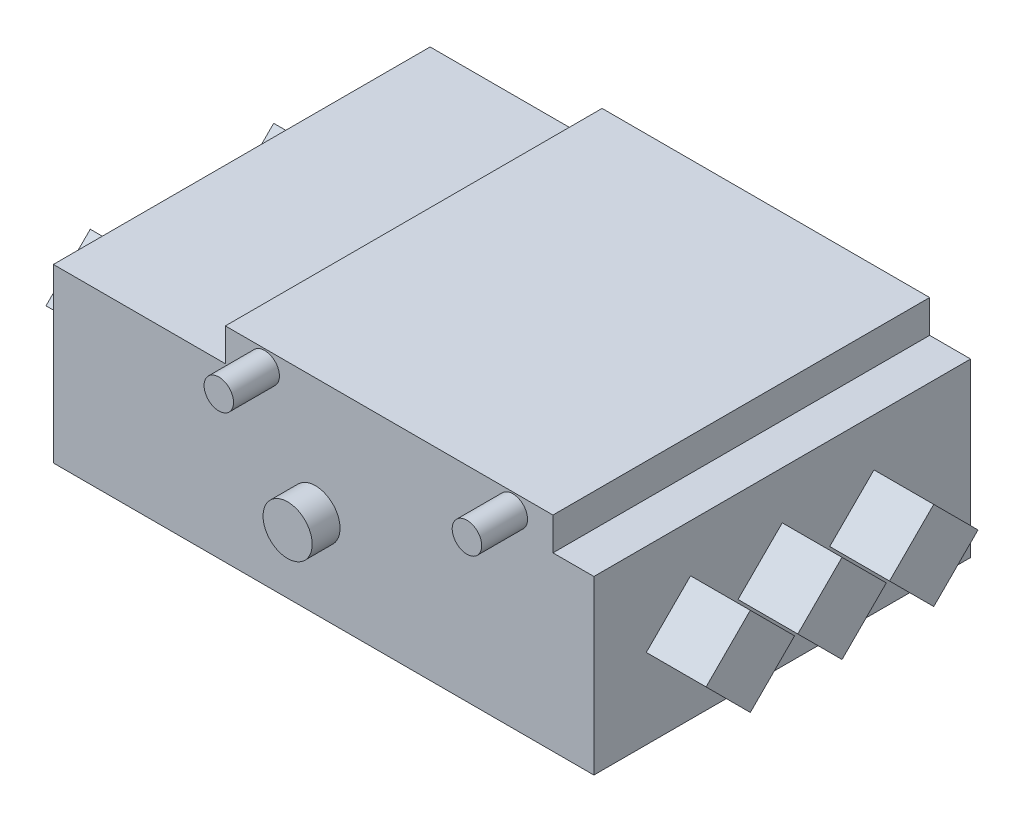
ISO-10303-21;
HEADER;
FILE_DESCRIPTION(('STEP AP214'),'2;1');
FILE_NAME('part.step','',(''),(''),'','','');
FILE_SCHEMA(('AUTOMOTIVE_DESIGN { 1 0 10303 214 1 1 1 1 }'));
ENDSEC;
DATA;
#1=APPLICATION_CONTEXT('core data for automotive mechanical design processes');
#2=APPLICATION_PROTOCOL_DEFINITION('international standard','automotive_design',2000,#1);
#3=PRODUCT_CONTEXT('',#1,'mechanical');
#4=PRODUCT('Part','Part','',(#3));
#5=PRODUCT_RELATED_PRODUCT_CATEGORY('part','',(#4));
#6=PRODUCT_DEFINITION_FORMATION('','',#4);
#7=PRODUCT_DEFINITION_CONTEXT('part definition',#1,'design');
#8=PRODUCT_DEFINITION('design','',#6,#7);
#9=PRODUCT_DEFINITION_SHAPE('','',#8);
#10=(LENGTH_UNIT() NAMED_UNIT(*) SI_UNIT(.MILLI.,.METRE.));
#11=(NAMED_UNIT(*) PLANE_ANGLE_UNIT() SI_UNIT($,.RADIAN.));
#12=(NAMED_UNIT(*) SI_UNIT($,.STERADIAN.) SOLID_ANGLE_UNIT());
#13=UNCERTAINTY_MEASURE_WITH_UNIT(LENGTH_MEASURE(1.E-05),#10,'distance_accuracy_value','');
#14=(GEOMETRIC_REPRESENTATION_CONTEXT(3) GLOBAL_UNCERTAINTY_ASSIGNED_CONTEXT((#13)) GLOBAL_UNIT_ASSIGNED_CONTEXT((#10,
#11,#12)) REPRESENTATION_CONTEXT('',''));
#15=CARTESIAN_POINT('',(0.,0.,0.));
#16=DIRECTION('',(0.,0.,1.));
#17=DIRECTION('',(1.,0.,0.));
#18=AXIS2_PLACEMENT_3D('',#15,#16,#17);
#19=CARTESIAN_POINT('',(-201.5,-3.63879009309075,198.011479041326));
#20=DIRECTION('',(0.,-0.707106781186546,-0.707106781186549));
#21=DIRECTION('',(0.,0.707106781186549,-0.707106781186546));
#22=AXIS2_PLACEMENT_3D('',#19,#20,#21);
#23=PLANE('',#22);
#24=DIRECTION('',(0.,-0.707106781186549,0.707106781186546));
#25=VECTOR('',#24,1.);
#26=CARTESIAN_POINT('',(-165.,-3.63879009309076,198.011479041326));
#27=LINE('',#26,#25);
#28=CARTESIAN_POINT('',(-165.,23.3726889482354,171.));
#29=VERTEX_POINT('',#28);
#30=CARTESIAN_POINT('',(-165.,-3.63879009309076,198.011479041326));
#31=VERTEX_POINT('',#30);
#32=EDGE_CURVE('E11',#29,#31,#27,.T.);
#33=ORIENTED_EDGE('',*,*,#32,.F.);
#34=DIRECTION('',(1.,0.,0.));
#35=VECTOR('',#34,1.);
#36=CARTESIAN_POINT('',(-201.5,23.3726889482354,171.));
#37=LINE('',#36,#35);
#38=CARTESIAN_POINT('',(-201.5,23.3726889482354,171.));
#39=VERTEX_POINT('',#38);
#40=EDGE_CURVE('E393',#39,#29,#37,.T.);
#41=ORIENTED_EDGE('',*,*,#40,.F.);
#42=DIRECTION('',(0.,-0.707106781186549,0.707106781186546));
#43=VECTOR('',#42,1.);
#44=CARTESIAN_POINT('',(-201.5,-3.63879009309075,198.011479041326));
#45=LINE('',#44,#43);
#46=CARTESIAN_POINT('',(-201.5,-3.63879009309075,198.011479041326));
#47=VERTEX_POINT('',#46);
#48=EDGE_CURVE('E402',#39,#47,#45,.T.);
#49=ORIENTED_EDGE('',*,*,#48,.T.);
#50=DIRECTION('',(1.,0.,0.));
#51=VECTOR('',#50,1.);
#52=CARTESIAN_POINT('',(-201.5,-3.63879009309075,198.011479041326));
#53=LINE('',#52,#51);
#54=EDGE_CURVE('E41',#47,#31,#53,.T.);
#55=ORIENTED_EDGE('',*,*,#54,.T.);
#56=EDGE_LOOP('',(#33,#41,#49,#55));
#57=FACE_BOUND('',#56,.T.);
#58=ADVANCED_FACE('F34',(#57),#23,.F.);
#59=CARTESIAN_POINT('',(-201.5,-3.63879009309075,198.011479041326));
#60=DIRECTION('',(0.,0.707106781186548,-0.707106781186546));
#61=DIRECTION('',(0.,0.707106781186547,0.707106781186549));
#62=AXIS2_PLACEMENT_3D('',#59,#60,#61);
#63=PLANE('',#62);
#64=DIRECTION('',(0.,-0.707106781186547,-0.707106781186549));
#65=VECTOR('',#64,1.);
#66=CARTESIAN_POINT('',(-165.,-3.63879009309076,198.011479041326));
#67=LINE('',#66,#65);
#68=CARTESIAN_POINT('',(-165.,-30.6502691344168,171.));
#69=VERTEX_POINT('',#68);
#70=EDGE_CURVE('E51',#31,#69,#67,.T.);
#71=ORIENTED_EDGE('',*,*,#70,.F.);
#72=ORIENTED_EDGE('',*,*,#54,.F.);
#73=DIRECTION('',(0.,-0.707106781186547,-0.707106781186549));
#74=VECTOR('',#73,1.);
#75=CARTESIAN_POINT('',(-201.5,-3.63879009309075,198.011479041326));
#76=LINE('',#75,#74);
#77=CARTESIAN_POINT('',(-201.5,-30.6502691344168,171.));
#78=VERTEX_POINT('',#77);
#79=EDGE_CURVE('E405',#47,#78,#76,.T.);
#80=ORIENTED_EDGE('',*,*,#79,.T.);
#81=DIRECTION('',(1.,0.,0.));
#82=VECTOR('',#81,1.);
#83=CARTESIAN_POINT('',(-201.5,-30.6502691344168,171.));
#84=LINE('',#83,#82);
#85=EDGE_CURVE('E412',#78,#69,#84,.T.);
#86=ORIENTED_EDGE('',*,*,#85,.T.);
#87=EDGE_LOOP('',(#71,#72,#80,#86));
#88=FACE_BOUND('',#87,.T.);
#89=ADVANCED_FACE('F418',(#88),#63,.F.);
#90=CARTESIAN_POINT('',(-201.5,-30.6502691344168,171.));
#91=DIRECTION('',(0.,0.707106781186546,0.707106781186548));
#92=DIRECTION('',(0.,-0.707106781186549,0.707106781186547));
#93=AXIS2_PLACEMENT_3D('',#90,#91,#92);
#94=PLANE('',#93);
#95=DIRECTION('',(0.,0.707106781186549,-0.707106781186547));
#96=VECTOR('',#95,1.);
#97=CARTESIAN_POINT('',(-165.,-30.6502691344168,171.));
#98=LINE('',#97,#96);
#99=CARTESIAN_POINT('',(-165.,-3.63879009309066,143.988520958674));
#100=VERTEX_POINT('',#99);
#101=EDGE_CURVE('E410',#69,#100,#98,.T.);
#102=ORIENTED_EDGE('',*,*,#101,.F.);
#103=ORIENTED_EDGE('',*,*,#85,.F.);
#104=DIRECTION('',(0.,0.707106781186549,-0.707106781186547));
#105=VECTOR('',#104,1.);
#106=CARTESIAN_POINT('',(-201.5,-30.6502691344168,171.));
#107=LINE('',#106,#105);
#108=CARTESIAN_POINT('',(-201.5,-3.63879009309065,143.988520958674));
#109=VERTEX_POINT('',#108);
#110=EDGE_CURVE('E408',#78,#109,#107,.T.);
#111=ORIENTED_EDGE('',*,*,#110,.T.);
#112=DIRECTION('',(1.,0.,0.));
#113=VECTOR('',#112,1.);
#114=CARTESIAN_POINT('',(-201.5,-3.63879009309065,143.988520958674));
#115=LINE('',#114,#113);
#116=EDGE_CURVE('E399',#109,#100,#115,.T.);
#117=ORIENTED_EDGE('',*,*,#116,.T.);
#118=EDGE_LOOP('',(#102,#103,#111,#117));
#119=FACE_BOUND('',#118,.T.);
#120=ADVANCED_FACE('F422',(#119),#94,.F.);
#121=CARTESIAN_POINT('',(-201.5,0.,0.));
#122=DIRECTION('',(1.,0.,0.));
#123=DIRECTION('',(0.,0.,1.));
#124=AXIS2_PLACEMENT_3D('',#121,#122,#123);
#125=PLANE('',#124);
#126=ORIENTED_EDGE('',*,*,#48,.F.);
#127=DIRECTION('',(0.,0.707106781186546,0.707106781186549));
#128=VECTOR('',#127,1.);
#129=CARTESIAN_POINT('',(-201.5,23.3726889482354,171.));
#130=LINE('',#129,#128);
#131=EDGE_CURVE('E396',#109,#39,#130,.T.);
#132=ORIENTED_EDGE('',*,*,#131,.F.);
#133=ORIENTED_EDGE('',*,*,#110,.F.);
#134=ORIENTED_EDGE('',*,*,#79,.F.);
#135=EDGE_LOOP('',(#126,#132,#133,#134));
#136=FACE_BOUND('',#135,.T.);
#137=ADVANCED_FACE('F431',(#136),#125,.F.);
#138=CARTESIAN_POINT('',(-201.5,23.3726889482354,171.));
#139=DIRECTION('',(0.,-0.707106781186549,0.707106781186546));
#140=DIRECTION('',(0.,-0.707106781186546,-0.707106781186549));
#141=AXIS2_PLACEMENT_3D('',#138,#139,#140);
#142=PLANE('',#141);
#143=DIRECTION('',(0.,0.707106781186546,0.707106781186549));
#144=VECTOR('',#143,1.);
#145=CARTESIAN_POINT('',(-165.,23.3726889482354,171.));
#146=LINE('',#145,#144);
#147=EDGE_CURVE('E391',#100,#29,#146,.T.);
#148=ORIENTED_EDGE('',*,*,#147,.F.);
#149=ORIENTED_EDGE('',*,*,#116,.F.);
#150=ORIENTED_EDGE('',*,*,#131,.T.);
#151=ORIENTED_EDGE('',*,*,#40,.T.);
#152=EDGE_LOOP('',(#148,#149,#150,#151));
#153=FACE_BOUND('',#152,.T.);
#154=ADVANCED_FACE('F428',(#153),#142,.F.);
#155=CARTESIAN_POINT('',(-201.5,-3.63879009308997,86.0114790413261));
#156=DIRECTION('',(0.,-0.707106781186546,-0.707106781186549));
#157=DIRECTION('',(0.,0.707106781186549,-0.707106781186546));
#158=AXIS2_PLACEMENT_3D('',#155,#156,#157);
#159=PLANE('',#158);
#160=DIRECTION('',(0.,-0.707106781186549,0.707106781186546));
#161=VECTOR('',#160,1.);
#162=CARTESIAN_POINT('',(-165.,-3.63879009308998,86.0114790413261));
#163=LINE('',#162,#161);
#164=CARTESIAN_POINT('',(-165.,23.3726889482362,59.));
#165=VERTEX_POINT('',#164);
#166=CARTESIAN_POINT('',(-165.,-3.63879009308998,86.0114790413261));
#167=VERTEX_POINT('',#166);
#168=EDGE_CURVE('E389',#165,#167,#163,.T.);
#169=ORIENTED_EDGE('',*,*,#168,.F.);
#170=DIRECTION('',(1.,0.,0.));
#171=VECTOR('',#170,1.);
#172=CARTESIAN_POINT('',(-201.5,23.3726889482362,59.));
#173=LINE('',#172,#171);
#174=CARTESIAN_POINT('',(-201.5,23.3726889482362,59.));
#175=VERTEX_POINT('',#174);
#176=EDGE_CURVE('E386',#175,#165,#173,.T.);
#177=ORIENTED_EDGE('',*,*,#176,.F.);
#178=DIRECTION('',(0.,-0.707106781186549,0.707106781186546));
#179=VECTOR('',#178,1.);
#180=CARTESIAN_POINT('',(-201.5,-3.63879009308997,86.0114790413261));
#181=LINE('',#180,#179);
#182=CARTESIAN_POINT('',(-201.5,-3.63879009308997,86.0114790413261));
#183=VERTEX_POINT('',#182);
#184=EDGE_CURVE('E369',#175,#183,#181,.T.);
#185=ORIENTED_EDGE('',*,*,#184,.T.);
#186=DIRECTION('',(1.,0.,0.));
#187=VECTOR('',#186,1.);
#188=CARTESIAN_POINT('',(-201.5,-3.63879009308997,86.0114790413261));
#189=LINE('',#188,#187);
#190=EDGE_CURVE('E366',#183,#167,#189,.T.);
#191=ORIENTED_EDGE('',*,*,#190,.T.);
#192=EDGE_LOOP('',(#169,#177,#185,#191));
#193=FACE_BOUND('',#192,.T.);
#194=ADVANCED_FACE('F438',(#193),#159,.F.);
#195=CARTESIAN_POINT('',(-201.5,23.3726889482362,59.));
#196=DIRECTION('',(0.,-0.707106781186549,0.707106781186546));
#197=DIRECTION('',(0.,-0.707106781186546,-0.707106781186549));
#198=AXIS2_PLACEMENT_3D('',#195,#196,#197);
#199=PLANE('',#198);
#200=DIRECTION('',(0.,0.707106781186546,0.707106781186549));
#201=VECTOR('',#200,1.);
#202=CARTESIAN_POINT('',(-165.,23.3726889482362,59.));
#203=LINE('',#202,#201);
#204=CARTESIAN_POINT('',(-165.,-3.63879009308986,31.9885209586739));
#205=VERTEX_POINT('',#204);
#206=EDGE_CURVE('E383',#205,#165,#203,.T.);
#207=ORIENTED_EDGE('',*,*,#206,.F.);
#208=DIRECTION('',(1.,0.,0.));
#209=VECTOR('',#208,1.);
#210=CARTESIAN_POINT('',(-201.5,-3.63879009308987,31.9885209586739));
#211=LINE('',#210,#209);
#212=CARTESIAN_POINT('',(-201.5,-3.63879009308987,31.9885209586739));
#213=VERTEX_POINT('',#212);
#214=EDGE_CURVE('E380',#213,#205,#211,.T.);
#215=ORIENTED_EDGE('',*,*,#214,.F.);
#216=DIRECTION('',(0.,0.707106781186546,0.707106781186549));
#217=VECTOR('',#216,1.);
#218=CARTESIAN_POINT('',(-201.5,23.3726889482362,59.));
#219=LINE('',#218,#217);
#220=EDGE_CURVE('E374',#213,#175,#219,.T.);
#221=ORIENTED_EDGE('',*,*,#220,.T.);
#222=ORIENTED_EDGE('',*,*,#176,.T.);
#223=EDGE_LOOP('',(#207,#215,#221,#222));
#224=FACE_BOUND('',#223,.T.);
#225=ADVANCED_FACE('F471',(#224),#199,.F.);
#226=CARTESIAN_POINT('',(-201.5,-30.650269134416,59.));
#227=DIRECTION('',(0.,0.707106781186546,0.707106781186549));
#228=DIRECTION('',(0.,-0.707106781186549,0.707106781186546));
#229=AXIS2_PLACEMENT_3D('',#226,#227,#228);
#230=PLANE('',#229);
#231=DIRECTION('',(0.,0.707106781186549,-0.707106781186546));
#232=VECTOR('',#231,1.);
#233=CARTESIAN_POINT('',(-165.,-30.650269134416,59.));
#234=LINE('',#233,#232);
#235=CARTESIAN_POINT('',(-165.,-30.650269134416,58.9999999999999));
#236=VERTEX_POINT('',#235);
#237=EDGE_CURVE('E377',#236,#205,#234,.T.);
#238=ORIENTED_EDGE('',*,*,#237,.F.);
#239=DIRECTION('',(1.,0.,0.));
#240=VECTOR('',#239,1.);
#241=CARTESIAN_POINT('',(-201.5,-30.650269134416,59.));
#242=LINE('',#241,#240);
#243=CARTESIAN_POINT('',(-201.5,-30.650269134416,59.));
#244=VERTEX_POINT('',#243);
#245=EDGE_CURVE('E359',#244,#236,#242,.T.);
#246=ORIENTED_EDGE('',*,*,#245,.F.);
#247=DIRECTION('',(0.,0.707106781186549,-0.707106781186546));
#248=VECTOR('',#247,1.);
#249=CARTESIAN_POINT('',(-201.5,-30.650269134416,59.));
#250=LINE('',#249,#248);
#251=EDGE_CURVE('E371',#244,#213,#250,.T.);
#252=ORIENTED_EDGE('',*,*,#251,.T.);
#253=ORIENTED_EDGE('',*,*,#214,.T.);
#254=EDGE_LOOP('',(#238,#246,#252,#253));
#255=FACE_BOUND('',#254,.T.);
#256=ADVANCED_FACE('F481',(#255),#230,.F.);
#257=CARTESIAN_POINT('',(-201.5,0.,0.));
#258=DIRECTION('',(1.,0.,0.));
#259=DIRECTION('',(0.,0.,1.));
#260=AXIS2_PLACEMENT_3D('',#257,#258,#259);
#261=PLANE('',#260);
#262=ORIENTED_EDGE('',*,*,#184,.F.);
#263=ORIENTED_EDGE('',*,*,#220,.F.);
#264=ORIENTED_EDGE('',*,*,#251,.F.);
#265=DIRECTION('',(0.,-0.707106781186546,-0.707106781186549));
#266=VECTOR('',#265,1.);
#267=CARTESIAN_POINT('',(-201.5,-3.63879009308997,86.0114790413261));
#268=LINE('',#267,#266);
#269=EDGE_CURVE('E363',#183,#244,#268,.T.);
#270=ORIENTED_EDGE('',*,*,#269,.F.);
#271=EDGE_LOOP('',(#262,#263,#264,#270));
#272=FACE_BOUND('',#271,.T.);
#273=ADVANCED_FACE('F491',(#272),#261,.F.);
#274=CARTESIAN_POINT('',(-201.5,-3.63879009308997,86.0114790413261));
#275=DIRECTION('',(0.,0.707106781186549,-0.707106781186546));
#276=DIRECTION('',(0.,0.707106781186546,0.707106781186549));
#277=AXIS2_PLACEMENT_3D('',#274,#275,#276);
#278=PLANE('',#277);
#279=DIRECTION('',(0.,-0.707106781186546,-0.707106781186549));
#280=VECTOR('',#279,1.);
#281=CARTESIAN_POINT('',(-165.,-3.63879009308998,86.0114790413261));
#282=LINE('',#281,#280);
#283=EDGE_CURVE('E356',#167,#236,#282,.T.);
#284=ORIENTED_EDGE('',*,*,#283,.F.);
#285=ORIENTED_EDGE('',*,*,#190,.F.);
#286=ORIENTED_EDGE('',*,*,#269,.T.);
#287=ORIENTED_EDGE('',*,*,#245,.T.);
#288=EDGE_LOOP('',(#284,#285,#286,#287));
#289=FACE_BOUND('',#288,.T.);
#290=ADVANCED_FACE('F501',(#289),#278,.F.);
#291=CARTESIAN_POINT('',(165.,52.5,230.));
#292=DIRECTION('',(-1.,0.,0.));
#293=DIRECTION('',(0.,-1.,0.));
#294=AXIS2_PLACEMENT_3D('',#291,#292,#293);
#295=PLANE('',#294);
#296=DIRECTION('',(0.,-0.707106781186549,0.707106781186546));
#297=VECTOR('',#296,1.);
#298=CARTESIAN_POINT('',(165.,-3.63879009309037,142.011479041326));
#299=LINE('',#298,#297);
#300=CARTESIAN_POINT('',(165.,23.3726889482358,115.));
#301=VERTEX_POINT('',#300);
#302=CARTESIAN_POINT('',(165.,-3.63879009309036,142.011479041326));
#303=VERTEX_POINT('',#302);
#304=EDGE_CURVE('E240',#301,#303,#299,.T.);
#305=ORIENTED_EDGE('',*,*,#304,.F.);
#306=DIRECTION('',(0.,0.707106781186546,0.707106781186549));
#307=VECTOR('',#306,1.);
#308=CARTESIAN_POINT('',(165.,23.3726889482358,115.));
#309=LINE('',#308,#307);
#310=CARTESIAN_POINT('',(165.,-3.63879009309027,87.9885209586739));
#311=VERTEX_POINT('',#310);
#312=EDGE_CURVE('E253',#311,#301,#309,.T.);
#313=ORIENTED_EDGE('',*,*,#312,.F.);
#314=DIRECTION('',(0.,0.707106781186549,-0.707106781186546));
#315=VECTOR('',#314,1.);
#316=CARTESIAN_POINT('',(165.,-30.6502691344164,115.));
#317=LINE('',#316,#315);
#318=CARTESIAN_POINT('',(165.,-30.6502691344164,115.));
#319=VERTEX_POINT('',#318);
#320=EDGE_CURVE('E262',#319,#311,#317,.T.);
#321=ORIENTED_EDGE('',*,*,#320,.F.);
#322=DIRECTION('',(0.,-0.707106781186546,-0.707106781186549));
#323=VECTOR('',#322,1.);
#324=CARTESIAN_POINT('',(165.,-3.63879009309037,142.011479041326));
#325=LINE('',#324,#323);
#326=EDGE_CURVE('E243',#303,#319,#325,.T.);
#327=ORIENTED_EDGE('',*,*,#326,.F.);
#328=EDGE_LOOP('',(#305,#313,#321,#327));
#329=FACE_BOUND('',#328,.T.);
#330=DIRECTION('',(0.,1.,0.));
#331=VECTOR('',#330,1.);
#332=CARTESIAN_POINT('',(165.,52.5,0.));
#333=LINE('',#332,#331);
#334=CARTESIAN_POINT('',(165.,-52.5,0.));
#335=VERTEX_POINT('',#334);
#336=CARTESIAN_POINT('',(165.,52.5,0.));
#337=VERTEX_POINT('',#336);
#338=EDGE_CURVE('E823',#335,#337,#333,.T.);
#339=ORIENTED_EDGE('',*,*,#338,.T.);
#340=DIRECTION('',(0.,0.,-1.));
#341=VECTOR('',#340,1.);
#342=CARTESIAN_POINT('',(165.,52.5,230.));
#343=LINE('',#342,#341);
#344=CARTESIAN_POINT('',(165.,52.5,230.));
#345=VERTEX_POINT('',#344);
#346=EDGE_CURVE('E360',#345,#337,#343,.T.);
#347=ORIENTED_EDGE('',*,*,#346,.F.);
#348=DIRECTION('',(0.,1.,0.));
#349=VECTOR('',#348,1.);
#350=CARTESIAN_POINT('',(165.,52.5,230.));
#351=LINE('',#350,#349);
#352=CARTESIAN_POINT('',(165.,-52.5,230.));
#353=VERTEX_POINT('',#352);
#354=EDGE_CURVE('E801',#353,#345,#351,.T.);
#355=ORIENTED_EDGE('',*,*,#354,.F.);
#356=DIRECTION('',(0.,0.,-1.));
#357=VECTOR('',#356,1.);
#358=CARTESIAN_POINT('',(165.,-52.5,230.));
#359=LINE('',#358,#357);
#360=EDGE_CURVE('E849',#353,#335,#359,.T.);
#361=ORIENTED_EDGE('',*,*,#360,.T.);
#362=EDGE_LOOP('',(#339,#347,#355,#361));
#363=FACE_BOUND('',#362,.T.);
#364=DIRECTION('',(0.,-0.707106781186549,0.707106781186546));
#365=VECTOR('',#364,1.);
#366=CARTESIAN_POINT('',(165.,-3.63879009308998,86.0114790413261));
#367=LINE('',#366,#365);
#368=CARTESIAN_POINT('',(165.,23.3726889482362,59.));
#369=VERTEX_POINT('',#368);
#370=CARTESIAN_POINT('',(165.,-3.63879009308998,86.0114790413261));
#371=VERTEX_POINT('',#370);
#372=EDGE_CURVE('E278',#369,#371,#367,.T.);
#373=ORIENTED_EDGE('',*,*,#372,.F.);
#374=DIRECTION('',(0.,0.707106781186546,0.707106781186549));
#375=VECTOR('',#374,1.);
#376=CARTESIAN_POINT('',(165.,23.3726889482362,59.));
#377=LINE('',#376,#375);
#378=CARTESIAN_POINT('',(165.,-3.63879009308986,31.9885209586739));
#379=VERTEX_POINT('',#378);
#380=EDGE_CURVE('E283',#379,#369,#377,.T.);
#381=ORIENTED_EDGE('',*,*,#380,.F.);
#382=DIRECTION('',(0.,0.707106781186549,-0.707106781186546));
#383=VECTOR('',#382,1.);
#384=CARTESIAN_POINT('',(165.,-30.650269134416,59.));
#385=LINE('',#384,#383);
#386=CARTESIAN_POINT('',(165.,-30.650269134416,58.9999999999999));
#387=VERTEX_POINT('',#386);
#388=EDGE_CURVE('E295',#387,#379,#385,.T.);
#389=ORIENTED_EDGE('',*,*,#388,.F.);
#390=DIRECTION('',(0.,-0.707106781186546,-0.707106781186549));
#391=VECTOR('',#390,1.);
#392=CARTESIAN_POINT('',(165.,-3.63879009308998,86.0114790413261));
#393=LINE('',#392,#391);
#394=EDGE_CURVE('E292',#371,#387,#393,.T.);
#395=ORIENTED_EDGE('',*,*,#394,.F.);
#396=EDGE_LOOP('',(#373,#381,#389,#395));
#397=FACE_BOUND('',#396,.T.);
#398=DIRECTION('',(0.,-0.707106781186549,0.707106781186546));
#399=VECTOR('',#398,1.);
#400=CARTESIAN_POINT('',(165.,-3.63879009309076,198.011479041326));
#401=LINE('',#400,#399);
#402=CARTESIAN_POINT('',(165.,23.3726889482354,171.));
#403=VERTEX_POINT('',#402);
#404=CARTESIAN_POINT('',(165.,-3.63879009309076,198.011479041326));
#405=VERTEX_POINT('',#404);
#406=EDGE_CURVE('E239',#403,#405,#401,.T.);
#407=ORIENTED_EDGE('',*,*,#406,.F.);
#408=DIRECTION('',(0.,0.707106781186546,0.707106781186549));
#409=VECTOR('',#408,1.);
#410=CARTESIAN_POINT('',(165.,23.3726889482354,171.));
#411=LINE('',#410,#409);
#412=CARTESIAN_POINT('',(165.,-3.63879009309066,143.988520958674));
#413=VERTEX_POINT('',#412);
#414=EDGE_CURVE('E236',#413,#403,#411,.T.);
#415=ORIENTED_EDGE('',*,*,#414,.F.);
#416=DIRECTION('',(0.,0.707106781186549,-0.707106781186547));
#417=VECTOR('',#416,1.);
#418=CARTESIAN_POINT('',(165.,-30.6502691344168,171.));
#419=LINE('',#418,#417);
#420=CARTESIAN_POINT('',(165.,-30.6502691344168,171.));
#421=VERTEX_POINT('',#420);
#422=EDGE_CURVE('E868',#421,#413,#419,.T.);
#423=ORIENTED_EDGE('',*,*,#422,.F.);
#424=DIRECTION('',(0.,-0.707106781186547,-0.707106781186549));
#425=VECTOR('',#424,1.);
#426=CARTESIAN_POINT('',(165.,-3.63879009309076,198.011479041326));
#427=LINE('',#426,#425);
#428=EDGE_CURVE('E863',#405,#421,#427,.T.);
#429=ORIENTED_EDGE('',*,*,#428,.F.);
#430=EDGE_LOOP('',(#407,#415,#423,#429));
#431=FACE_BOUND('',#430,.T.);
#432=ADVANCED_FACE('F511',(#329,#363,#397,#431),#295,.F.);
#433=CARTESIAN_POINT('',(0.,0.,230.));
#434=DIRECTION('',(0.,0.,1.));
#435=DIRECTION('',(1.,0.,0.));
#436=AXIS2_PLACEMENT_3D('',#433,#434,#435);
#437=PLANE('',#436);
#438=CARTESIAN_POINT('',(-36.,62.5,230.));
#439=DIRECTION('',(0.,0.,1.));
#440=DIRECTION('',(1.,0.,0.));
#441=AXIS2_PLACEMENT_3D('',#438,#439,#440);
#442=CIRCLE('',#441,9.00000000000001);
#443=CARTESIAN_POINT('',(-26.9999999999999,62.5,230.));
#444=VERTEX_POINT('',#443);
#445=EDGE_CURVE('E318',#444,#444,#442,.T.);
#446=ORIENTED_EDGE('',*,*,#445,.F.);
#447=EDGE_LOOP('',(#446));
#448=FACE_BOUND('',#447,.T.);
#449=ORIENTED_EDGE('',*,*,#354,.T.);
#450=DIRECTION('',(-1.,0.,0.));
#451=VECTOR('',#450,1.);
#452=CARTESIAN_POINT('',(-165.,52.5,230.));
#453=LINE('',#452,#451);
#454=CARTESIAN_POINT('',(140.,52.5,230.));
#455=VERTEX_POINT('',#454);
#456=EDGE_CURVE('E790',#345,#455,#453,.T.);
#457=ORIENTED_EDGE('',*,*,#456,.T.);
#458=DIRECTION('',(0.,-1.,0.));
#459=VECTOR('',#458,1.);
#460=CARTESIAN_POINT('',(140.,72.5,230.));
#461=LINE('',#460,#459);
#462=CARTESIAN_POINT('',(140.,72.5,230.));
#463=VERTEX_POINT('',#462);
#464=EDGE_CURVE('E340',#463,#455,#461,.T.);
#465=ORIENTED_EDGE('',*,*,#464,.F.);
#466=DIRECTION('',(1.,0.,0.));
#467=VECTOR('',#466,1.);
#468=CARTESIAN_POINT('',(140.,72.5,230.));
#469=LINE('',#468,#467);
#470=CARTESIAN_POINT('',(-59.9999999999999,72.5,230.));
#471=VERTEX_POINT('',#470);
#472=EDGE_CURVE('E338',#471,#463,#469,.T.);
#473=ORIENTED_EDGE('',*,*,#472,.F.);
#474=DIRECTION('',(0.,-1.,0.));
#475=VECTOR('',#474,1.);
#476=CARTESIAN_POINT('',(-59.9999999999999,72.5,230.));
#477=LINE('',#476,#475);
#478=CARTESIAN_POINT('',(-59.9999999999999,52.5,230.));
#479=VERTEX_POINT('',#478);
#480=EDGE_CURVE('E353',#471,#479,#477,.T.);
#481=ORIENTED_EDGE('',*,*,#480,.T.);
#482=CARTESIAN_POINT('',(-165.,52.5,230.));
#483=VERTEX_POINT('',#482);
#484=EDGE_CURVE('E804',#479,#483,#453,.T.);
#485=ORIENTED_EDGE('',*,*,#484,.T.);
#486=DIRECTION('',(0.,-1.,0.));
#487=VECTOR('',#486,1.);
#488=CARTESIAN_POINT('',(-165.,52.5,230.));
#489=LINE('',#488,#487);
#490=CARTESIAN_POINT('',(-165.,-52.5,230.));
#491=VERTEX_POINT('',#490);
#492=EDGE_CURVE('E803',#483,#491,#489,.T.);
#493=ORIENTED_EDGE('',*,*,#492,.T.);
#494=DIRECTION('',(1.,0.,0.));
#495=VECTOR('',#494,1.);
#496=CARTESIAN_POINT('',(-165.,-52.5,230.));
#497=LINE('',#496,#495);
#498=EDGE_CURVE('E833',#491,#353,#497,.T.);
#499=ORIENTED_EDGE('',*,*,#498,.T.);
#500=EDGE_LOOP('',(#449,#457,#465,#473,#481,#485,#493,#499));
#501=FACE_BOUND('',#500,.T.);
#502=CARTESIAN_POINT('',(115.5,62.5,230.));
#503=DIRECTION('',(0.,0.,1.));
#504=DIRECTION('',(1.,0.,0.));
#505=AXIS2_PLACEMENT_3D('',#502,#503,#504);
#506=CIRCLE('',#505,9.00000000000001);
#507=CARTESIAN_POINT('',(124.5,62.5,230.));
#508=VERTEX_POINT('',#507);
#509=EDGE_CURVE('E321',#508,#508,#506,.T.);
#510=ORIENTED_EDGE('',*,*,#509,.F.);
#511=EDGE_LOOP('',(#510));
#512=FACE_BOUND('',#511,.T.);
#513=CARTESIAN_POINT('',(-4.99999999999995,0.499999999999994,230.));
#514=DIRECTION('',(0.,0.,1.));
#515=DIRECTION('',(1.,0.,0.));
#516=AXIS2_PLACEMENT_3D('',#513,#514,#515);
#517=CIRCLE('',#516,15.);
#518=CARTESIAN_POINT('',(10.,0.499999999999994,230.));
#519=VERTEX_POINT('',#518);
#520=EDGE_CURVE('E311',#519,#519,#517,.T.);
#521=ORIENTED_EDGE('',*,*,#520,.F.);
#522=EDGE_LOOP('',(#521));
#523=FACE_BOUND('',#522,.T.);
#524=ADVANCED_FACE('F624',(#448,#501,#512,#523),#437,.T.);
#525=CARTESIAN_POINT('',(-165.,52.5,230.));
#526=DIRECTION('',(0.,-1.,0.));
#527=DIRECTION('',(0.,0.,-1.));
#528=AXIS2_PLACEMENT_3D('',#525,#526,#527);
#529=PLANE('',#528);
#530=DIRECTION('',(0.,0.,-1.));
#531=VECTOR('',#530,1.);
#532=CARTESIAN_POINT('',(140.,52.5,0.));
#533=LINE('',#532,#531);
#534=CARTESIAN_POINT('',(140.,52.5,0.));
#535=VERTEX_POINT('',#534);
#536=EDGE_CURVE('E327',#455,#535,#533,.T.);
#537=ORIENTED_EDGE('',*,*,#536,.F.);
#538=ORIENTED_EDGE('',*,*,#456,.F.);
#539=ORIENTED_EDGE('',*,*,#346,.T.);
#540=DIRECTION('',(-1.,0.,0.));
#541=VECTOR('',#540,1.);
#542=CARTESIAN_POINT('',(-165.,52.5,0.));
#543=LINE('',#542,#541);
#544=EDGE_CURVE('E792',#337,#535,#543,.T.);
#545=ORIENTED_EDGE('',*,*,#544,.T.);
#546=EDGE_LOOP('',(#537,#538,#539,#545));
#547=FACE_BOUND('',#546,.T.);
#548=ADVANCED_FACE('F782',(#547),#529,.F.);
#549=DIRECTION('',(0.,0.,1.));
#550=VECTOR('',#549,1.);
#551=CARTESIAN_POINT('',(-60.,52.5,0.));
#552=LINE('',#551,#550);
#553=CARTESIAN_POINT('',(-60.,52.5,0.));
#554=VERTEX_POINT('',#553);
#555=EDGE_CURVE('E334',#554,#479,#552,.T.);
#556=ORIENTED_EDGE('',*,*,#555,.F.);
#557=CARTESIAN_POINT('',(-165.,52.5,0.));
#558=VERTEX_POINT('',#557);
#559=EDGE_CURVE('E825',#554,#558,#543,.T.);
#560=ORIENTED_EDGE('',*,*,#559,.T.);
#561=DIRECTION('',(0.,0.,-1.));
#562=VECTOR('',#561,1.);
#563=CARTESIAN_POINT('',(-165.,52.5,230.));
#564=LINE('',#563,#562);
#565=EDGE_CURVE('E843',#483,#558,#564,.T.);
#566=ORIENTED_EDGE('',*,*,#565,.F.);
#567=ORIENTED_EDGE('',*,*,#484,.F.);
#568=EDGE_LOOP('',(#556,#560,#566,#567));
#569=FACE_BOUND('',#568,.T.);
#570=ADVANCED_FACE('F521',(#569),#529,.F.);
#571=CARTESIAN_POINT('',(-165.,52.5,230.));
#572=DIRECTION('',(1.,0.,0.));
#573=DIRECTION('',(0.,1.,0.));
#574=AXIS2_PLACEMENT_3D('',#571,#572,#573);
#575=PLANE('',#574);
#576=ORIENTED_EDGE('',*,*,#32,.T.);
#577=ORIENTED_EDGE('',*,*,#70,.T.);
#578=ORIENTED_EDGE('',*,*,#101,.T.);
#579=ORIENTED_EDGE('',*,*,#147,.T.);
#580=EDGE_LOOP('',(#576,#577,#578,#579));
#581=FACE_BOUND('',#580,.T.);
#582=ORIENTED_EDGE('',*,*,#168,.T.);
#583=ORIENTED_EDGE('',*,*,#283,.T.);
#584=ORIENTED_EDGE('',*,*,#237,.T.);
#585=ORIENTED_EDGE('',*,*,#206,.T.);
#586=EDGE_LOOP('',(#582,#583,#584,#585));
#587=FACE_BOUND('',#586,.T.);
#588=DIRECTION('',(0.,-1.,0.));
#589=VECTOR('',#588,1.);
#590=CARTESIAN_POINT('',(-165.,52.5,0.));
#591=LINE('',#590,#589);
#592=CARTESIAN_POINT('',(-165.,-52.5,0.));
#593=VERTEX_POINT('',#592);
#594=EDGE_CURVE('E837',#558,#593,#591,.T.);
#595=ORIENTED_EDGE('',*,*,#594,.T.);
#596=DIRECTION('',(0.,0.,-1.));
#597=VECTOR('',#596,1.);
#598=CARTESIAN_POINT('',(-165.,-52.5,230.));
#599=LINE('',#598,#597);
#600=EDGE_CURVE('E846',#491,#593,#599,.T.);
#601=ORIENTED_EDGE('',*,*,#600,.F.);
#602=ORIENTED_EDGE('',*,*,#492,.F.);
#603=ORIENTED_EDGE('',*,*,#565,.T.);
#604=EDGE_LOOP('',(#595,#601,#602,#603));
#605=FACE_BOUND('',#604,.T.);
#606=ADVANCED_FACE('F425',(#581,#587,#605),#575,.F.);
#607=CARTESIAN_POINT('',(-165.,-52.5,230.));
#608=DIRECTION('',(0.,1.,0.));
#609=DIRECTION('',(0.,0.,1.));
#610=AXIS2_PLACEMENT_3D('',#607,#608,#609);
#611=PLANE('',#610);
#612=DIRECTION('',(1.,0.,0.));
#613=VECTOR('',#612,1.);
#614=CARTESIAN_POINT('',(-165.,-52.5,0.));
#615=LINE('',#614,#613);
#616=EDGE_CURVE('E850',#593,#335,#615,.T.);
#617=ORIENTED_EDGE('',*,*,#616,.T.);
#618=ORIENTED_EDGE('',*,*,#360,.F.);
#619=ORIENTED_EDGE('',*,*,#498,.F.);
#620=ORIENTED_EDGE('',*,*,#600,.T.);
#621=EDGE_LOOP('',(#617,#618,#619,#620));
#622=FACE_BOUND('',#621,.T.);
#623=ADVANCED_FACE('F520',(#622),#611,.F.);
#624=CARTESIAN_POINT('',(0.,0.,0.));
#625=DIRECTION('',(0.,0.,1.));
#626=DIRECTION('',(1.,0.,0.));
#627=AXIS2_PLACEMENT_3D('',#624,#625,#626);
#628=PLANE('',#627);
#629=ORIENTED_EDGE('',*,*,#338,.F.);
#630=ORIENTED_EDGE('',*,*,#616,.F.);
#631=ORIENTED_EDGE('',*,*,#594,.F.);
#632=ORIENTED_EDGE('',*,*,#559,.F.);
#633=DIRECTION('',(0.,-1.,0.));
#634=VECTOR('',#633,1.);
#635=CARTESIAN_POINT('',(-60.,72.5,0.));
#636=LINE('',#635,#634);
#637=CARTESIAN_POINT('',(-60.,72.5,0.));
#638=VERTEX_POINT('',#637);
#639=EDGE_CURVE('E813',#638,#554,#636,.T.);
#640=ORIENTED_EDGE('',*,*,#639,.F.);
#641=DIRECTION('',(-1.,0.,0.));
#642=VECTOR('',#641,1.);
#643=CARTESIAN_POINT('',(140.,72.5,0.));
#644=LINE('',#643,#642);
#645=CARTESIAN_POINT('',(140.,72.5,0.));
#646=VERTEX_POINT('',#645);
#647=EDGE_CURVE('E333',#646,#638,#644,.T.);
#648=ORIENTED_EDGE('',*,*,#647,.F.);
#649=DIRECTION('',(0.,-1.,0.));
#650=VECTOR('',#649,1.);
#651=CARTESIAN_POINT('',(140.,72.5,0.));
#652=LINE('',#651,#650);
#653=EDGE_CURVE('E806',#646,#535,#652,.T.);
#654=ORIENTED_EDGE('',*,*,#653,.T.);
#655=ORIENTED_EDGE('',*,*,#544,.F.);
#656=EDGE_LOOP('',(#629,#630,#631,#632,#640,#648,#654,#655));
#657=FACE_BOUND('',#656,.T.);
#658=ADVANCED_FACE('F536',(#657),#628,.F.);
#659=CARTESIAN_POINT('',(140.,72.5,0.));
#660=DIRECTION('',(-1.,0.,0.));
#661=DIRECTION('',(0.,0.,1.));
#662=AXIS2_PLACEMENT_3D('',#659,#660,#661);
#663=PLANE('',#662);
#664=ORIENTED_EDGE('',*,*,#536,.T.);
#665=ORIENTED_EDGE('',*,*,#653,.F.);
#666=DIRECTION('',(0.,0.,-1.));
#667=VECTOR('',#666,1.);
#668=CARTESIAN_POINT('',(140.,72.5,0.));
#669=LINE('',#668,#667);
#670=EDGE_CURVE('E330',#463,#646,#669,.T.);
#671=ORIENTED_EDGE('',*,*,#670,.F.);
#672=ORIENTED_EDGE('',*,*,#464,.T.);
#673=EDGE_LOOP('',(#664,#665,#671,#672));
#674=FACE_BOUND('',#673,.T.);
#675=ADVANCED_FACE('F544',(#674),#663,.F.);
#676=CARTESIAN_POINT('',(-60.,72.5,0.));
#677=DIRECTION('',(1.,0.,0.));
#678=DIRECTION('',(0.,0.,-1.));
#679=AXIS2_PLACEMENT_3D('',#676,#677,#678);
#680=PLANE('',#679);
#681=ORIENTED_EDGE('',*,*,#555,.T.);
#682=ORIENTED_EDGE('',*,*,#480,.F.);
#683=DIRECTION('',(0.,0.,1.));
#684=VECTOR('',#683,1.);
#685=CARTESIAN_POINT('',(-60.,72.5,0.));
#686=LINE('',#685,#684);
#687=EDGE_CURVE('E336',#638,#471,#686,.T.);
#688=ORIENTED_EDGE('',*,*,#687,.F.);
#689=ORIENTED_EDGE('',*,*,#639,.T.);
#690=EDGE_LOOP('',(#681,#682,#688,#689));
#691=FACE_BOUND('',#690,.T.);
#692=ADVANCED_FACE('F552',(#691),#680,.F.);
#693=CARTESIAN_POINT('',(0.,72.5,0.));
#694=DIRECTION('',(0.,-1.,0.));
#695=DIRECTION('',(0.,0.,-1.));
#696=AXIS2_PLACEMENT_3D('',#693,#694,#695);
#697=PLANE('',#696);
#698=ORIENTED_EDGE('',*,*,#670,.T.);
#699=ORIENTED_EDGE('',*,*,#647,.T.);
#700=ORIENTED_EDGE('',*,*,#687,.T.);
#701=ORIENTED_EDGE('',*,*,#472,.T.);
#702=EDGE_LOOP('',(#698,#699,#700,#701));
#703=FACE_BOUND('',#702,.T.);
#704=ADVANCED_FACE('F560',(#703),#697,.F.);
#705=CARTESIAN_POINT('',(115.5,62.5,258.));
#706=DIRECTION('',(0.,0.,-1.));
#707=DIRECTION('',(-1.,0.,0.));
#708=AXIS2_PLACEMENT_3D('',#705,#706,#707);
#709=CYLINDRICAL_SURFACE('',#708,9.00000000000001);
#710=CARTESIAN_POINT('',(115.5,62.5,258.));
#711=DIRECTION('',(0.,0.,1.));
#712=DIRECTION('',(1.,0.,0.));
#713=AXIS2_PLACEMENT_3D('',#710,#711,#712);
#714=CIRCLE('',#713,9.00000000000001);
#715=CARTESIAN_POINT('',(124.5,62.5,258.));
#716=VERTEX_POINT('',#715);
#717=EDGE_CURVE('E324',#716,#716,#714,.T.);
#718=ORIENTED_EDGE('',*,*,#717,.F.);
#719=EDGE_LOOP('',(#718));
#720=FACE_BOUND('',#719,.T.);
#721=ORIENTED_EDGE('',*,*,#509,.T.);
#722=EDGE_LOOP('',(#721));
#723=FACE_BOUND('',#722,.T.);
#724=ADVANCED_FACE('F568',(#720,#723),#709,.T.);
#725=CARTESIAN_POINT('',(115.5,62.5,258.));
#726=DIRECTION('',(0.,0.,1.));
#727=DIRECTION('',(1.,0.,0.));
#728=AXIS2_PLACEMENT_3D('',#725,#726,#727);
#729=PLANE('',#728);
#730=ORIENTED_EDGE('',*,*,#717,.T.);
#731=EDGE_LOOP('',(#730));
#732=FACE_BOUND('',#731,.T.);
#733=ADVANCED_FACE('F576',(#732),#729,.T.);
#734=CARTESIAN_POINT('',(-36.,62.5,258.));
#735=DIRECTION('',(0.,0.,-1.));
#736=DIRECTION('',(-1.,0.,0.));
#737=AXIS2_PLACEMENT_3D('',#734,#735,#736);
#738=CYLINDRICAL_SURFACE('',#737,9.00000000000001);
#739=CARTESIAN_POINT('',(-36.,62.5,258.));
#740=DIRECTION('',(0.,0.,1.));
#741=DIRECTION('',(1.,0.,0.));
#742=AXIS2_PLACEMENT_3D('',#739,#740,#741);
#743=CIRCLE('',#742,9.00000000000001);
#744=CARTESIAN_POINT('',(-26.9999999999999,62.5,258.));
#745=VERTEX_POINT('',#744);
#746=EDGE_CURVE('E315',#745,#745,#743,.T.);
#747=ORIENTED_EDGE('',*,*,#746,.F.);
#748=EDGE_LOOP('',(#747));
#749=FACE_BOUND('',#748,.T.);
#750=ORIENTED_EDGE('',*,*,#445,.T.);
#751=EDGE_LOOP('',(#750));
#752=FACE_BOUND('',#751,.T.);
#753=ADVANCED_FACE('F584',(#749,#752),#738,.T.);
#754=CARTESIAN_POINT('',(-36.,62.5,258.));
#755=DIRECTION('',(0.,0.,1.));
#756=DIRECTION('',(1.,0.,0.));
#757=AXIS2_PLACEMENT_3D('',#754,#755,#756);
#758=PLANE('',#757);
#759=ORIENTED_EDGE('',*,*,#746,.T.);
#760=EDGE_LOOP('',(#759));
#761=FACE_BOUND('',#760,.T.);
#762=ADVANCED_FACE('F592',(#761),#758,.T.);
#763=CARTESIAN_POINT('',(-4.99999999999995,0.499999999999994,247.));
#764=DIRECTION('',(0.,0.,-1.));
#765=DIRECTION('',(-1.,0.,0.));
#766=AXIS2_PLACEMENT_3D('',#763,#764,#765);
#767=CYLINDRICAL_SURFACE('',#766,15.);
#768=CARTESIAN_POINT('',(-4.99999999999995,0.499999999999994,247.));
#769=DIRECTION('',(0.,0.,1.));
#770=DIRECTION('',(1.,0.,0.));
#771=AXIS2_PLACEMENT_3D('',#768,#769,#770);
#772=CIRCLE('',#771,15.);
#773=CARTESIAN_POINT('',(10.,0.499999999999994,247.));
#774=VERTEX_POINT('',#773);
#775=EDGE_CURVE('E312',#774,#774,#772,.T.);
#776=ORIENTED_EDGE('',*,*,#775,.F.);
#777=EDGE_LOOP('',(#776));
#778=FACE_BOUND('',#777,.T.);
#779=ORIENTED_EDGE('',*,*,#520,.T.);
#780=EDGE_LOOP('',(#779));
#781=FACE_BOUND('',#780,.T.);
#782=ADVANCED_FACE('F600',(#778,#781),#767,.T.);
#783=CARTESIAN_POINT('',(0.,0.,247.));
#784=DIRECTION('',(0.,0.,1.));
#785=DIRECTION('',(1.,0.,0.));
#786=AXIS2_PLACEMENT_3D('',#783,#784,#785);
#787=PLANE('',#786);
#788=ORIENTED_EDGE('',*,*,#775,.T.);
#789=EDGE_LOOP('',(#788));
#790=FACE_BOUND('',#789,.T.);
#791=ADVANCED_FACE('F609',(#790),#787,.T.);
#792=CARTESIAN_POINT('',(201.5,-3.63879009308997,86.0114790413261));
#793=DIRECTION('',(0.,-0.707106781186546,-0.707106781186549));
#794=DIRECTION('',(0.,0.707106781186549,-0.707106781186546));
#795=AXIS2_PLACEMENT_3D('',#792,#793,#794);
#796=PLANE('',#795);
#797=ORIENTED_EDGE('',*,*,#372,.T.);
#798=DIRECTION('',(-1.,0.,0.));
#799=VECTOR('',#798,1.);
#800=CARTESIAN_POINT('',(201.5,-3.63879009308997,86.0114790413261));
#801=LINE('',#800,#799);
#802=CARTESIAN_POINT('',(201.5,-3.63879009308997,86.0114790413261));
#803=VERTEX_POINT('',#802);
#804=EDGE_CURVE('E308',#803,#371,#801,.T.);
#805=ORIENTED_EDGE('',*,*,#804,.F.);
#806=DIRECTION('',(0.,-0.707106781186549,0.707106781186546));
#807=VECTOR('',#806,1.);
#808=CARTESIAN_POINT('',(201.5,-3.63879009308997,86.0114790413261));
#809=LINE('',#808,#807);
#810=CARTESIAN_POINT('',(201.5,23.3726889482362,59.));
#811=VERTEX_POINT('',#810);
#812=EDGE_CURVE('E279',#811,#803,#809,.T.);
#813=ORIENTED_EDGE('',*,*,#812,.F.);
#814=DIRECTION('',(-1.,0.,0.));
#815=VECTOR('',#814,1.);
#816=CARTESIAN_POINT('',(201.5,23.3726889482362,59.));
#817=LINE('',#816,#815);
#818=EDGE_CURVE('E289',#811,#369,#817,.T.);
#819=ORIENTED_EDGE('',*,*,#818,.T.);
#820=EDGE_LOOP('',(#797,#805,#813,#819));
#821=FACE_BOUND('',#820,.T.);
#822=ADVANCED_FACE('F616',(#821),#796,.F.);
#823=CARTESIAN_POINT('',(201.5,-3.63879009308997,86.0114790413261));
#824=DIRECTION('',(0.,0.707106781186549,-0.707106781186546));
#825=DIRECTION('',(0.,0.707106781186546,0.707106781186549));
#826=AXIS2_PLACEMENT_3D('',#823,#824,#825);
#827=PLANE('',#826);
#828=ORIENTED_EDGE('',*,*,#394,.T.);
#829=DIRECTION('',(-1.,0.,0.));
#830=VECTOR('',#829,1.);
#831=CARTESIAN_POINT('',(201.5,-30.650269134416,59.));
#832=LINE('',#831,#830);
#833=CARTESIAN_POINT('',(201.5,-30.650269134416,59.));
#834=VERTEX_POINT('',#833);
#835=EDGE_CURVE('E305',#834,#387,#832,.T.);
#836=ORIENTED_EDGE('',*,*,#835,.F.);
#837=DIRECTION('',(0.,-0.707106781186546,-0.707106781186549));
#838=VECTOR('',#837,1.);
#839=CARTESIAN_POINT('',(201.5,-3.63879009308997,86.0114790413261));
#840=LINE('',#839,#838);
#841=EDGE_CURVE('E282',#803,#834,#840,.T.);
#842=ORIENTED_EDGE('',*,*,#841,.F.);
#843=ORIENTED_EDGE('',*,*,#804,.T.);
#844=EDGE_LOOP('',(#828,#836,#842,#843));
#845=FACE_BOUND('',#844,.T.);
#846=ADVANCED_FACE('F637',(#845),#827,.F.);
#847=CARTESIAN_POINT('',(201.5,-30.650269134416,59.));
#848=DIRECTION('',(0.,0.707106781186546,0.707106781186549));
#849=DIRECTION('',(0.,-0.707106781186549,0.707106781186546));
#850=AXIS2_PLACEMENT_3D('',#847,#848,#849);
#851=PLANE('',#850);
#852=ORIENTED_EDGE('',*,*,#388,.T.);
#853=DIRECTION('',(-1.,0.,0.));
#854=VECTOR('',#853,1.);
#855=CARTESIAN_POINT('',(201.5,-3.63879009308987,31.9885209586739));
#856=LINE('',#855,#854);
#857=CARTESIAN_POINT('',(201.5,-3.63879009308987,31.9885209586739));
#858=VERTEX_POINT('',#857);
#859=EDGE_CURVE('E302',#858,#379,#856,.T.);
#860=ORIENTED_EDGE('',*,*,#859,.F.);
#861=DIRECTION('',(0.,0.707106781186549,-0.707106781186546));
#862=VECTOR('',#861,1.);
#863=CARTESIAN_POINT('',(201.5,-30.650269134416,59.));
#864=LINE('',#863,#862);
#865=EDGE_CURVE('E285',#834,#858,#864,.T.);
#866=ORIENTED_EDGE('',*,*,#865,.F.);
#867=ORIENTED_EDGE('',*,*,#835,.T.);
#868=EDGE_LOOP('',(#852,#860,#866,#867));
#869=FACE_BOUND('',#868,.T.);
#870=ADVANCED_FACE('F646',(#869),#851,.F.);
#871=CARTESIAN_POINT('',(201.5,23.3726889482362,59.));
#872=DIRECTION('',(0.,-0.707106781186549,0.707106781186546));
#873=DIRECTION('',(0.,-0.707106781186546,-0.707106781186549));
#874=AXIS2_PLACEMENT_3D('',#871,#872,#873);
#875=PLANE('',#874);
#876=ORIENTED_EDGE('',*,*,#380,.T.);
#877=ORIENTED_EDGE('',*,*,#818,.F.);
#878=DIRECTION('',(0.,0.707106781186546,0.707106781186549));
#879=VECTOR('',#878,1.);
#880=CARTESIAN_POINT('',(201.5,23.3726889482362,59.));
#881=LINE('',#880,#879);
#882=EDGE_CURVE('E287',#858,#811,#881,.T.);
#883=ORIENTED_EDGE('',*,*,#882,.F.);
#884=ORIENTED_EDGE('',*,*,#859,.T.);
#885=EDGE_LOOP('',(#876,#877,#883,#884));
#886=FACE_BOUND('',#885,.T.);
#887=ADVANCED_FACE('F655',(#886),#875,.F.);
#888=CARTESIAN_POINT('',(201.5,0.,0.));
#889=DIRECTION('',(-1.,0.,0.));
#890=DIRECTION('',(0.,0.,1.));
#891=AXIS2_PLACEMENT_3D('',#888,#889,#890);
#892=PLANE('',#891);
#893=ORIENTED_EDGE('',*,*,#812,.T.);
#894=ORIENTED_EDGE('',*,*,#841,.T.);
#895=ORIENTED_EDGE('',*,*,#865,.T.);
#896=ORIENTED_EDGE('',*,*,#882,.T.);
#897=EDGE_LOOP('',(#893,#894,#895,#896));
#898=FACE_BOUND('',#897,.T.);
#899=ADVANCED_FACE('F664',(#898),#892,.F.);
#900=CARTESIAN_POINT('',(201.5,-3.63879009309036,142.011479041326));
#901=DIRECTION('',(0.,-0.707106781186546,-0.707106781186549));
#902=DIRECTION('',(0.,0.707106781186549,-0.707106781186546));
#903=AXIS2_PLACEMENT_3D('',#900,#901,#902);
#904=PLANE('',#903);
#905=ORIENTED_EDGE('',*,*,#304,.T.);
#906=DIRECTION('',(-1.,0.,0.));
#907=VECTOR('',#906,1.);
#908=CARTESIAN_POINT('',(201.5,-3.63879009309036,142.011479041326));
#909=LINE('',#908,#907);
#910=CARTESIAN_POINT('',(201.5,-3.63879009309036,142.011479041326));
#911=VERTEX_POINT('',#910);
#912=EDGE_CURVE('E275',#911,#303,#909,.T.);
#913=ORIENTED_EDGE('',*,*,#912,.F.);
#914=DIRECTION('',(0.,-0.707106781186549,0.707106781186546));
#915=VECTOR('',#914,1.);
#916=CARTESIAN_POINT('',(201.5,-3.63879009309036,142.011479041326));
#917=LINE('',#916,#915);
#918=CARTESIAN_POINT('',(201.5,23.3726889482358,115.));
#919=VERTEX_POINT('',#918);
#920=EDGE_CURVE('E249',#919,#911,#917,.T.);
#921=ORIENTED_EDGE('',*,*,#920,.F.);
#922=DIRECTION('',(-1.,0.,0.));
#923=VECTOR('',#922,1.);
#924=CARTESIAN_POINT('',(201.5,23.3726889482358,115.));
#925=LINE('',#924,#923);
#926=EDGE_CURVE('E258',#919,#301,#925,.T.);
#927=ORIENTED_EDGE('',*,*,#926,.T.);
#928=EDGE_LOOP('',(#905,#913,#921,#927));
#929=FACE_BOUND('',#928,.T.);
#930=ADVANCED_FACE('F673',(#929),#904,.F.);
#931=CARTESIAN_POINT('',(201.5,-3.63879009309036,142.011479041326));
#932=DIRECTION('',(0.,0.707106781186549,-0.707106781186546));
#933=DIRECTION('',(0.,0.707106781186546,0.707106781186549));
#934=AXIS2_PLACEMENT_3D('',#931,#932,#933);
#935=PLANE('',#934);
#936=ORIENTED_EDGE('',*,*,#326,.T.);
#937=DIRECTION('',(-1.,0.,0.));
#938=VECTOR('',#937,1.);
#939=CARTESIAN_POINT('',(201.5,-30.6502691344164,115.));
#940=LINE('',#939,#938);
#941=CARTESIAN_POINT('',(201.5,-30.6502691344164,115.));
#942=VERTEX_POINT('',#941);
#943=EDGE_CURVE('E272',#942,#319,#940,.T.);
#944=ORIENTED_EDGE('',*,*,#943,.F.);
#945=DIRECTION('',(0.,-0.707106781186546,-0.707106781186549));
#946=VECTOR('',#945,1.);
#947=CARTESIAN_POINT('',(201.5,-3.63879009309036,142.011479041326));
#948=LINE('',#947,#946);
#949=EDGE_CURVE('E252',#911,#942,#948,.T.);
#950=ORIENTED_EDGE('',*,*,#949,.F.);
#951=ORIENTED_EDGE('',*,*,#912,.T.);
#952=EDGE_LOOP('',(#936,#944,#950,#951));
#953=FACE_BOUND('',#952,.T.);
#954=ADVANCED_FACE('F682',(#953),#935,.F.);
#955=CARTESIAN_POINT('',(201.5,-30.6502691344164,115.));
#956=DIRECTION('',(0.,0.707106781186546,0.707106781186549));
#957=DIRECTION('',(0.,-0.707106781186549,0.707106781186546));
#958=AXIS2_PLACEMENT_3D('',#955,#956,#957);
#959=PLANE('',#958);
#960=ORIENTED_EDGE('',*,*,#320,.T.);
#961=DIRECTION('',(-1.,0.,0.));
#962=VECTOR('',#961,1.);
#963=CARTESIAN_POINT('',(201.5,-3.63879009309026,87.9885209586739));
#964=LINE('',#963,#962);
#965=CARTESIAN_POINT('',(201.5,-3.63879009309026,87.9885209586739));
#966=VERTEX_POINT('',#965);
#967=EDGE_CURVE('E269',#966,#311,#964,.T.);
#968=ORIENTED_EDGE('',*,*,#967,.F.);
#969=DIRECTION('',(0.,0.707106781186549,-0.707106781186546));
#970=VECTOR('',#969,1.);
#971=CARTESIAN_POINT('',(201.5,-30.6502691344164,115.));
#972=LINE('',#971,#970);
#973=EDGE_CURVE('E255',#942,#966,#972,.T.);
#974=ORIENTED_EDGE('',*,*,#973,.F.);
#975=ORIENTED_EDGE('',*,*,#943,.T.);
#976=EDGE_LOOP('',(#960,#968,#974,#975));
#977=FACE_BOUND('',#976,.T.);
#978=ADVANCED_FACE('F691',(#977),#959,.F.);
#979=CARTESIAN_POINT('',(201.5,23.3726889482358,115.));
#980=DIRECTION('',(0.,-0.707106781186549,0.707106781186546));
#981=DIRECTION('',(0.,-0.707106781186546,-0.707106781186549));
#982=AXIS2_PLACEMENT_3D('',#979,#980,#981);
#983=PLANE('',#982);
#984=ORIENTED_EDGE('',*,*,#312,.T.);
#985=ORIENTED_EDGE('',*,*,#926,.F.);
#986=DIRECTION('',(0.,0.707106781186546,0.707106781186549));
#987=VECTOR('',#986,1.);
#988=CARTESIAN_POINT('',(201.5,23.3726889482358,115.));
#989=LINE('',#988,#987);
#990=EDGE_CURVE('E257',#966,#919,#989,.T.);
#991=ORIENTED_EDGE('',*,*,#990,.F.);
#992=ORIENTED_EDGE('',*,*,#967,.T.);
#993=EDGE_LOOP('',(#984,#985,#991,#992));
#994=FACE_BOUND('',#993,.T.);
#995=ADVANCED_FACE('F700',(#994),#983,.F.);
#996=CARTESIAN_POINT('',(201.5,0.,0.));
#997=DIRECTION('',(-1.,0.,0.));
#998=DIRECTION('',(0.,0.,1.));
#999=AXIS2_PLACEMENT_3D('',#996,#997,#998);
#1000=PLANE('',#999);
#1001=ORIENTED_EDGE('',*,*,#920,.T.);
#1002=ORIENTED_EDGE('',*,*,#949,.T.);
#1003=ORIENTED_EDGE('',*,*,#973,.T.);
#1004=ORIENTED_EDGE('',*,*,#990,.T.);
#1005=EDGE_LOOP('',(#1001,#1002,#1003,#1004));
#1006=FACE_BOUND('',#1005,.T.);
#1007=ADVANCED_FACE('F709',(#1006),#1000,.F.);
#1008=CARTESIAN_POINT('',(201.5,-3.63879009309075,198.011479041326));
#1009=DIRECTION('',(0.,-0.707106781186546,-0.707106781186549));
#1010=DIRECTION('',(0.,0.707106781186549,-0.707106781186546));
#1011=AXIS2_PLACEMENT_3D('',#1008,#1009,#1010);
#1012=PLANE('',#1011);
#1013=ORIENTED_EDGE('',*,*,#406,.T.);
#1014=DIRECTION('',(-1.,0.,0.));
#1015=VECTOR('',#1014,1.);
#1016=CARTESIAN_POINT('',(201.5,-3.63879009309075,198.011479041326));
#1017=LINE('',#1016,#1015);
#1018=CARTESIAN_POINT('',(201.5,-3.63879009309075,198.011479041326));
#1019=VERTEX_POINT('',#1018);
#1020=EDGE_CURVE('E220',#1019,#405,#1017,.T.);
#1021=ORIENTED_EDGE('',*,*,#1020,.F.);
#1022=DIRECTION('',(0.,-0.707106781186549,0.707106781186546));
#1023=VECTOR('',#1022,1.);
#1024=CARTESIAN_POINT('',(201.5,-3.63879009309075,198.011479041326));
#1025=LINE('',#1024,#1023);
#1026=CARTESIAN_POINT('',(201.5,23.3726889482354,171.));
#1027=VERTEX_POINT('',#1026);
#1028=EDGE_CURVE('E227',#1027,#1019,#1025,.T.);
#1029=ORIENTED_EDGE('',*,*,#1028,.F.);
#1030=DIRECTION('',(-1.,0.,0.));
#1031=VECTOR('',#1030,1.);
#1032=CARTESIAN_POINT('',(201.5,23.3726889482354,171.));
#1033=LINE('',#1032,#1031);
#1034=EDGE_CURVE('E866',#1027,#403,#1033,.T.);
#1035=ORIENTED_EDGE('',*,*,#1034,.T.);
#1036=EDGE_LOOP('',(#1013,#1021,#1029,#1035));
#1037=FACE_BOUND('',#1036,.T.);
#1038=ADVANCED_FACE('F238',(#1037),#1012,.F.);
#1039=CARTESIAN_POINT('',(201.5,-3.63879009309075,198.011479041326));
#1040=DIRECTION('',(0.,0.707106781186548,-0.707106781186546));
#1041=DIRECTION('',(0.,0.707106781186547,0.707106781186549));
#1042=AXIS2_PLACEMENT_3D('',#1039,#1040,#1041);
#1043=PLANE('',#1042);
#1044=ORIENTED_EDGE('',*,*,#428,.T.);
#1045=DIRECTION('',(-1.,0.,0.));
#1046=VECTOR('',#1045,1.);
#1047=CARTESIAN_POINT('',(201.5,-30.6502691344168,171.));
#1048=LINE('',#1047,#1046);
#1049=CARTESIAN_POINT('',(201.5,-30.6502691344168,171.));
#1050=VERTEX_POINT('',#1049);
#1051=EDGE_CURVE('E223',#1050,#421,#1048,.T.);
#1052=ORIENTED_EDGE('',*,*,#1051,.F.);
#1053=DIRECTION('',(0.,-0.707106781186547,-0.707106781186549));
#1054=VECTOR('',#1053,1.);
#1055=CARTESIAN_POINT('',(201.5,-3.63879009309075,198.011479041326));
#1056=LINE('',#1055,#1054);
#1057=EDGE_CURVE('E215',#1019,#1050,#1056,.T.);
#1058=ORIENTED_EDGE('',*,*,#1057,.F.);
#1059=ORIENTED_EDGE('',*,*,#1020,.T.);
#1060=EDGE_LOOP('',(#1044,#1052,#1058,#1059));
#1061=FACE_BOUND('',#1060,.T.);
#1062=ADVANCED_FACE('F218',(#1061),#1043,.F.);
#1063=CARTESIAN_POINT('',(201.5,-30.6502691344168,171.));
#1064=DIRECTION('',(0.,0.707106781186546,0.707106781186548));
#1065=DIRECTION('',(0.,-0.707106781186549,0.707106781186547));
#1066=AXIS2_PLACEMENT_3D('',#1063,#1064,#1065);
#1067=PLANE('',#1066);
#1068=ORIENTED_EDGE('',*,*,#422,.T.);
#1069=DIRECTION('',(-1.,0.,0.));
#1070=VECTOR('',#1069,1.);
#1071=CARTESIAN_POINT('',(201.5,-3.63879009309065,143.988520958674));
#1072=LINE('',#1071,#1070);
#1073=CARTESIAN_POINT('',(201.5,-3.63879009309065,143.988520958674));
#1074=VERTEX_POINT('',#1073);
#1075=EDGE_CURVE('E245',#1074,#413,#1072,.T.);
#1076=ORIENTED_EDGE('',*,*,#1075,.F.);
#1077=DIRECTION('',(0.,0.707106781186549,-0.707106781186547));
#1078=VECTOR('',#1077,1.);
#1079=CARTESIAN_POINT('',(201.5,-30.6502691344168,171.));
#1080=LINE('',#1079,#1078);
#1081=EDGE_CURVE('E226',#1050,#1074,#1080,.T.);
#1082=ORIENTED_EDGE('',*,*,#1081,.F.);
#1083=ORIENTED_EDGE('',*,*,#1051,.T.);
#1084=EDGE_LOOP('',(#1068,#1076,#1082,#1083));
#1085=FACE_BOUND('',#1084,.T.);
#1086=ADVANCED_FACE('F733',(#1085),#1067,.F.);
#1087=CARTESIAN_POINT('',(201.5,23.3726889482354,171.));
#1088=DIRECTION('',(0.,-0.707106781186549,0.707106781186546));
#1089=DIRECTION('',(0.,-0.707106781186546,-0.707106781186549));
#1090=AXIS2_PLACEMENT_3D('',#1087,#1088,#1089);
#1091=PLANE('',#1090);
#1092=ORIENTED_EDGE('',*,*,#414,.T.);
#1093=ORIENTED_EDGE('',*,*,#1034,.F.);
#1094=DIRECTION('',(0.,0.707106781186546,0.707106781186549));
#1095=VECTOR('',#1094,1.);
#1096=CARTESIAN_POINT('',(201.5,23.3726889482354,171.));
#1097=LINE('',#1096,#1095);
#1098=EDGE_CURVE('E232',#1074,#1027,#1097,.T.);
#1099=ORIENTED_EDGE('',*,*,#1098,.F.);
#1100=ORIENTED_EDGE('',*,*,#1075,.T.);
#1101=EDGE_LOOP('',(#1092,#1093,#1099,#1100));
#1102=FACE_BOUND('',#1101,.T.);
#1103=ADVANCED_FACE('F741',(#1102),#1091,.F.);
#1104=CARTESIAN_POINT('',(201.5,0.,0.));
#1105=DIRECTION('',(-1.,0.,0.));
#1106=DIRECTION('',(0.,0.,1.));
#1107=AXIS2_PLACEMENT_3D('',#1104,#1105,#1106);
#1108=PLANE('',#1107);
#1109=ORIENTED_EDGE('',*,*,#1028,.T.);
#1110=ORIENTED_EDGE('',*,*,#1057,.T.);
#1111=ORIENTED_EDGE('',*,*,#1081,.T.);
#1112=ORIENTED_EDGE('',*,*,#1098,.T.);
#1113=EDGE_LOOP('',(#1109,#1110,#1111,#1112));
#1114=FACE_BOUND('',#1113,.T.);
#1115=ADVANCED_FACE('F230',(#1114),#1108,.F.);
#1116=CLOSED_SHELL('',(#58,#89,#120,#137,#154,#194,#225,#256,#273,#290,#432,#524,#548,#570,#606,
#623,#658,#675,#692,#704,#724,#733,#753,#762,#782,#791,#822,#846,#870,#887,#899,#930,#954,#978,
#995,#1007,#1038,#1062,#1086,#1103,#1115));
#1117=MANIFOLD_SOLID_BREP('B2',#1116);
#1118=ADVANCED_BREP_SHAPE_REPRESENTATION('',(#18,#1117),#14);
#1119=SHAPE_DEFINITION_REPRESENTATION(#9,#1118);
ENDSEC;
END-ISO-10303-21;
